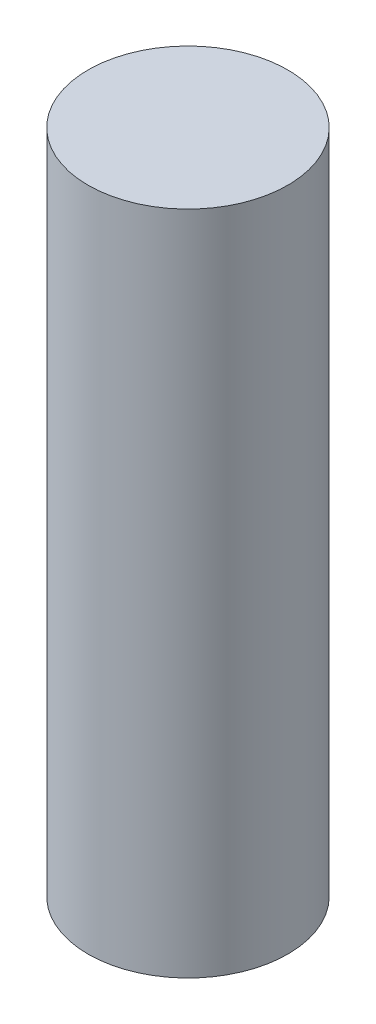
ISO-10303-21;
HEADER;
FILE_DESCRIPTION(('STEP AP214'),'2;1');
FILE_NAME('part.step','',(''),(''),'','','');
FILE_SCHEMA(('AUTOMOTIVE_DESIGN { 1 0 10303 214 1 1 1 1 }'));
ENDSEC;
DATA;
#1=APPLICATION_CONTEXT('core data for automotive mechanical design processes');
#2=APPLICATION_PROTOCOL_DEFINITION('international standard','automotive_design',2000,#1);
#3=PRODUCT_CONTEXT('',#1,'mechanical');
#4=PRODUCT('Part','Part','',(#3));
#5=PRODUCT_RELATED_PRODUCT_CATEGORY('part','',(#4));
#6=PRODUCT_DEFINITION_FORMATION('','',#4);
#7=PRODUCT_DEFINITION_CONTEXT('part definition',#1,'design');
#8=PRODUCT_DEFINITION('design','',#6,#7);
#9=PRODUCT_DEFINITION_SHAPE('','',#8);
#10=(LENGTH_UNIT() NAMED_UNIT(*) SI_UNIT(.MILLI.,.METRE.));
#11=(NAMED_UNIT(*) PLANE_ANGLE_UNIT() SI_UNIT($,.RADIAN.));
#12=(NAMED_UNIT(*) SI_UNIT($,.STERADIAN.) SOLID_ANGLE_UNIT());
#13=UNCERTAINTY_MEASURE_WITH_UNIT(LENGTH_MEASURE(1.E-05),#10,'distance_accuracy_value','');
#14=(GEOMETRIC_REPRESENTATION_CONTEXT(3) GLOBAL_UNCERTAINTY_ASSIGNED_CONTEXT((#13)) GLOBAL_UNIT_ASSIGNED_CONTEXT((#10,
#11,#12)) REPRESENTATION_CONTEXT('',''));
#15=CARTESIAN_POINT('',(0.,0.,0.));
#16=DIRECTION('',(0.,0.,1.));
#17=DIRECTION('',(1.,0.,0.));
#18=AXIS2_PLACEMENT_3D('',#15,#16,#17);
#19=CARTESIAN_POINT('',(0.,5.,0.));
#20=DIRECTION('',(0.,-1.,0.));
#21=DIRECTION('',(0.,0.,-1.));
#22=AXIS2_PLACEMENT_3D('',#19,#20,#21);
#23=CYLINDRICAL_SURFACE('',#22,0.75);
#24=CARTESIAN_POINT('',(0.,5.,0.));
#25=DIRECTION('',(0.,1.,0.));
#26=DIRECTION('',(0.,0.,1.));
#27=AXIS2_PLACEMENT_3D('',#24,#25,#26);
#28=CIRCLE('',#27,0.75);
#29=CARTESIAN_POINT('',(0.,5.,0.75));
#30=VERTEX_POINT('',#29);
#31=EDGE_CURVE('E10',#30,#30,#28,.T.);
#32=ORIENTED_EDGE('',*,*,#31,.F.);
#33=EDGE_LOOP('',(#32));
#34=FACE_BOUND('',#33,.T.);
#35=CARTESIAN_POINT('',(0.,0.,0.));
#36=DIRECTION('',(0.,1.,0.));
#37=DIRECTION('',(0.,0.,1.));
#38=AXIS2_PLACEMENT_3D('',#35,#36,#37);
#39=CIRCLE('',#38,0.75);
#40=CARTESIAN_POINT('',(0.,0.,0.75));
#41=VERTEX_POINT('',#40);
#42=EDGE_CURVE('E34',#41,#41,#39,.T.);
#43=ORIENTED_EDGE('',*,*,#42,.T.);
#44=EDGE_LOOP('',(#43));
#45=FACE_BOUND('',#44,.T.);
#46=ADVANCED_FACE('F31',(#34,#45),#23,.T.);
#47=CARTESIAN_POINT('',(0.,5.,0.));
#48=DIRECTION('',(0.,1.,0.));
#49=DIRECTION('',(0.,0.,1.));
#50=AXIS2_PLACEMENT_3D('',#47,#48,#49);
#51=PLANE('',#50);
#52=ORIENTED_EDGE('',*,*,#31,.T.);
#53=EDGE_LOOP('',(#52));
#54=FACE_BOUND('',#53,.T.);
#55=ADVANCED_FACE('F46',(#54),#51,.T.);
#56=CARTESIAN_POINT('',(0.,0.,0.));
#57=DIRECTION('',(0.,1.,0.));
#58=DIRECTION('',(0.,0.,1.));
#59=AXIS2_PLACEMENT_3D('',#56,#57,#58);
#60=PLANE('',#59);
#61=ORIENTED_EDGE('',*,*,#42,.F.);
#62=EDGE_LOOP('',(#61));
#63=FACE_BOUND('',#62,.T.);
#64=ADVANCED_FACE('F44',(#63),#60,.F.);
#65=CLOSED_SHELL('',(#46,#55,#64));
#66=MANIFOLD_SOLID_BREP('B2',#65);
#67=ADVANCED_BREP_SHAPE_REPRESENTATION('',(#18,#66),#14);
#68=SHAPE_DEFINITION_REPRESENTATION(#9,#67);
ENDSEC;
END-ISO-10303-21;
